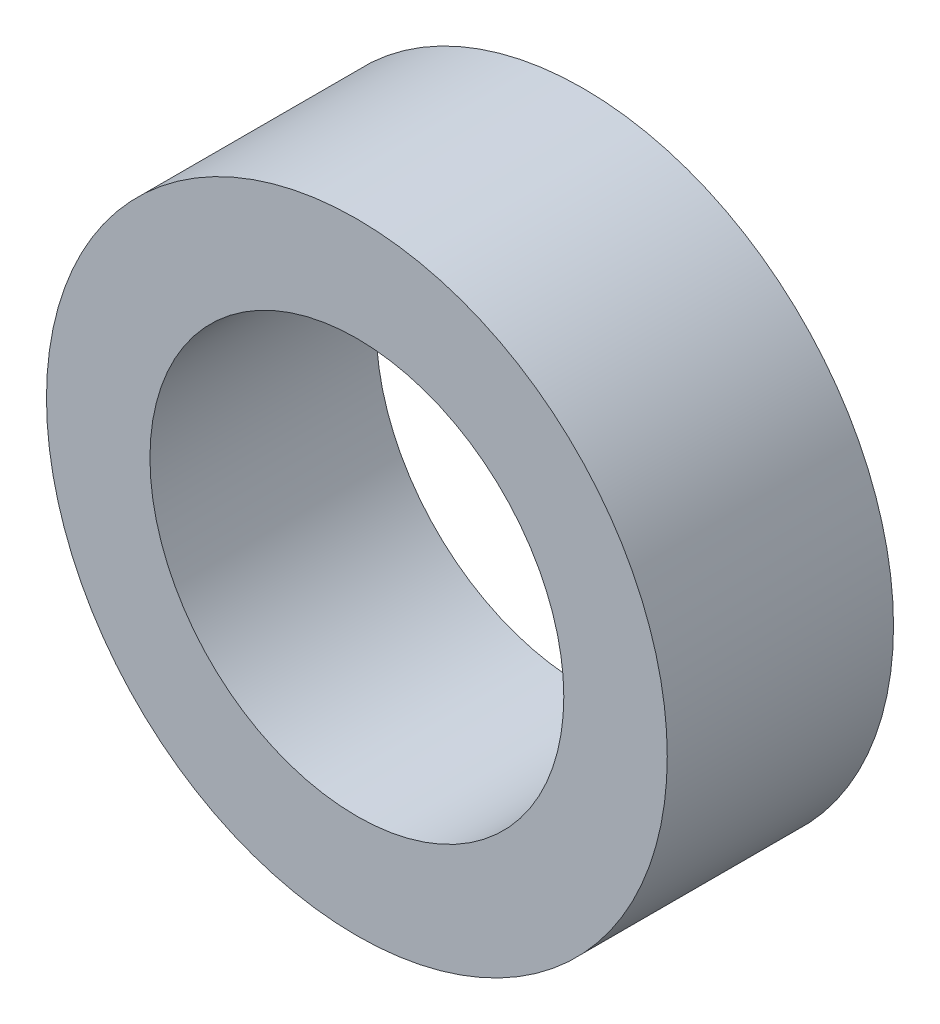
ISO-10303-21;
HEADER;
FILE_DESCRIPTION(('STEP AP214'),'2;1');
FILE_NAME('part.step','',(''),(''),'','','');
FILE_SCHEMA(('AUTOMOTIVE_DESIGN { 1 0 10303 214 1 1 1 1 }'));
ENDSEC;
DATA;
#1=APPLICATION_CONTEXT('core data for automotive mechanical design processes');
#2=APPLICATION_PROTOCOL_DEFINITION('international standard','automotive_design',2000,#1);
#3=PRODUCT_CONTEXT('',#1,'mechanical');
#4=PRODUCT('Part','Part','',(#3));
#5=PRODUCT_RELATED_PRODUCT_CATEGORY('part','',(#4));
#6=PRODUCT_DEFINITION_FORMATION('','',#4);
#7=PRODUCT_DEFINITION_CONTEXT('part definition',#1,'design');
#8=PRODUCT_DEFINITION('design','',#6,#7);
#9=PRODUCT_DEFINITION_SHAPE('','',#8);
#10=(LENGTH_UNIT() NAMED_UNIT(*) SI_UNIT(.MILLI.,.METRE.));
#11=(NAMED_UNIT(*) PLANE_ANGLE_UNIT() SI_UNIT($,.RADIAN.));
#12=(NAMED_UNIT(*) SI_UNIT($,.STERADIAN.) SOLID_ANGLE_UNIT());
#13=UNCERTAINTY_MEASURE_WITH_UNIT(LENGTH_MEASURE(1.E-05),#10,'distance_accuracy_value','');
#14=(GEOMETRIC_REPRESENTATION_CONTEXT(3) GLOBAL_UNCERTAINTY_ASSIGNED_CONTEXT((#13)) GLOBAL_UNIT_ASSIGNED_CONTEXT((#10,
#11,#12)) REPRESENTATION_CONTEXT('',''));
#15=CARTESIAN_POINT('',(0.,0.,0.));
#16=DIRECTION('',(0.,0.,1.));
#17=DIRECTION('',(1.,0.,0.));
#18=AXIS2_PLACEMENT_3D('',#15,#16,#17);
#19=CARTESIAN_POINT('',(-32.9,-31.,1.64));
#20=DIRECTION('',(0.,0.,1.));
#21=DIRECTION('',(-1.,0.,0.));
#22=AXIS2_PLACEMENT_3D('',#19,#20,#21);
#23=CYLINDRICAL_SURFACE('',#22,2.25);
#24=CARTESIAN_POINT('',(-32.9,-31.,1.64));
#25=DIRECTION('',(0.,0.,1.));
#26=DIRECTION('',(1.,0.,0.));
#27=AXIS2_PLACEMENT_3D('',#24,#25,#26);
#28=CIRCLE('',#27,2.25);
#29=CARTESIAN_POINT('',(-30.65,-31.,1.64));
#30=VERTEX_POINT('',#29);
#31=EDGE_CURVE('E27',#30,#30,#28,.T.);
#32=ORIENTED_EDGE('',*,*,#31,.F.);
#33=EDGE_LOOP('',(#32));
#34=FACE_BOUND('',#33,.T.);
#35=CARTESIAN_POINT('',(-32.9,-31.,0.));
#36=DIRECTION('',(0.,0.,1.));
#37=DIRECTION('',(1.,0.,0.));
#38=AXIS2_PLACEMENT_3D('',#35,#36,#37);
#39=CIRCLE('',#38,2.25);
#40=CARTESIAN_POINT('',(-30.65,-31.,0.));
#41=VERTEX_POINT('',#40);
#42=EDGE_CURVE('E52',#41,#41,#39,.T.);
#43=ORIENTED_EDGE('',*,*,#42,.T.);
#44=EDGE_LOOP('',(#43));
#45=FACE_BOUND('',#44,.T.);
#46=ADVANCED_FACE('F17',(#34,#45),#23,.T.);
#47=CARTESIAN_POINT('',(-32.9,-31.,1.64));
#48=DIRECTION('',(0.,0.,1.));
#49=DIRECTION('',(-1.,0.,0.));
#50=AXIS2_PLACEMENT_3D('',#47,#48,#49);
#51=CYLINDRICAL_SURFACE('',#50,1.5);
#52=CARTESIAN_POINT('',(-32.9,-31.,1.64));
#53=DIRECTION('',(0.,0.,1.));
#54=DIRECTION('',(1.,0.,0.));
#55=AXIS2_PLACEMENT_3D('',#52,#53,#54);
#56=CIRCLE('',#55,1.5);
#57=CARTESIAN_POINT('',(-31.4,-31.,1.64));
#58=VERTEX_POINT('',#57);
#59=EDGE_CURVE('E11',#58,#58,#56,.T.);
#60=ORIENTED_EDGE('',*,*,#59,.T.);
#61=EDGE_LOOP('',(#60));
#62=FACE_BOUND('',#61,.T.);
#63=CARTESIAN_POINT('',(-32.9,-31.,0.));
#64=DIRECTION('',(0.,0.,1.));
#65=DIRECTION('',(1.,0.,0.));
#66=AXIS2_PLACEMENT_3D('',#63,#64,#65);
#67=CIRCLE('',#66,1.5);
#68=CARTESIAN_POINT('',(-31.4,-31.,0.));
#69=VERTEX_POINT('',#68);
#70=EDGE_CURVE('E46',#69,#69,#67,.T.);
#71=ORIENTED_EDGE('',*,*,#70,.F.);
#72=EDGE_LOOP('',(#71));
#73=FACE_BOUND('',#72,.T.);
#74=ADVANCED_FACE('F19',(#62,#73),#51,.F.);
#75=CARTESIAN_POINT('',(-17.7,-16.75,1.64));
#76=DIRECTION('',(0.,0.,1.));
#77=DIRECTION('',(1.,0.,0.));
#78=AXIS2_PLACEMENT_3D('',#75,#76,#77);
#79=PLANE('',#78);
#80=ORIENTED_EDGE('',*,*,#59,.F.);
#81=EDGE_LOOP('',(#80));
#82=FACE_BOUND('',#81,.T.);
#83=ORIENTED_EDGE('',*,*,#31,.T.);
#84=EDGE_LOOP('',(#83));
#85=FACE_BOUND('',#84,.T.);
#86=ADVANCED_FACE('F63',(#82,#85),#79,.T.);
#87=CARTESIAN_POINT('',(-17.7,-16.75,0.));
#88=DIRECTION('',(0.,0.,1.));
#89=DIRECTION('',(1.,0.,0.));
#90=AXIS2_PLACEMENT_3D('',#87,#88,#89);
#91=PLANE('',#90);
#92=ORIENTED_EDGE('',*,*,#70,.T.);
#93=EDGE_LOOP('',(#92));
#94=FACE_BOUND('',#93,.T.);
#95=ORIENTED_EDGE('',*,*,#42,.F.);
#96=EDGE_LOOP('',(#95));
#97=FACE_BOUND('',#96,.T.);
#98=ADVANCED_FACE('F73',(#94,#97),#91,.F.);
#99=CLOSED_SHELL('',(#46,#74,#86,#98));
#100=MANIFOLD_SOLID_BREP('B1',#99);
#101=ADVANCED_BREP_SHAPE_REPRESENTATION('',(#18,#100),#14);
#102=SHAPE_DEFINITION_REPRESENTATION(#9,#101);
ENDSEC;
END-ISO-10303-21;
